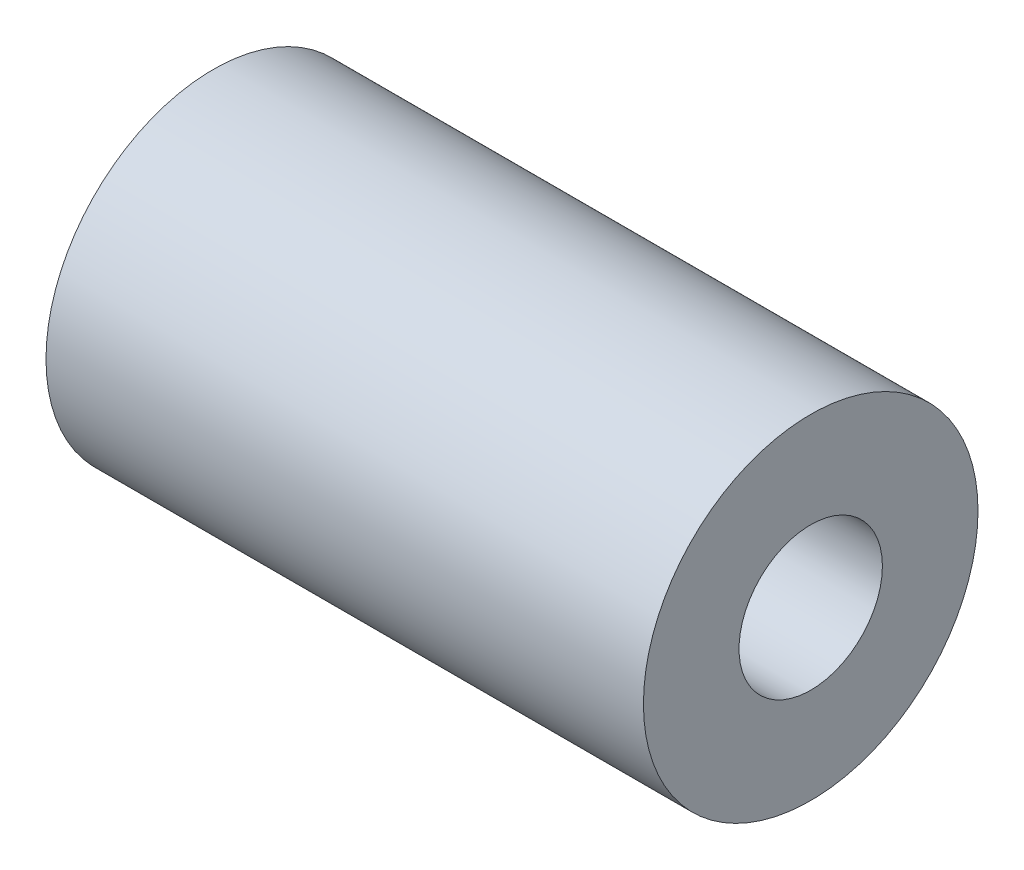
ISO-10303-21;
HEADER;
FILE_DESCRIPTION(('STEP AP214'),'2;1');
FILE_NAME('part.step','',(''),(''),'','','');
FILE_SCHEMA(('AUTOMOTIVE_DESIGN { 1 0 10303 214 1 1 1 1 }'));
ENDSEC;
DATA;
#1=APPLICATION_CONTEXT('core data for automotive mechanical design processes');
#2=APPLICATION_PROTOCOL_DEFINITION('international standard','automotive_design',2000,#1);
#3=PRODUCT_CONTEXT('',#1,'mechanical');
#4=PRODUCT('Part','Part','',(#3));
#5=PRODUCT_RELATED_PRODUCT_CATEGORY('part','',(#4));
#6=PRODUCT_DEFINITION_FORMATION('','',#4);
#7=PRODUCT_DEFINITION_CONTEXT('part definition',#1,'design');
#8=PRODUCT_DEFINITION('design','',#6,#7);
#9=PRODUCT_DEFINITION_SHAPE('','',#8);
#10=(LENGTH_UNIT() NAMED_UNIT(*) SI_UNIT(.MILLI.,.METRE.));
#11=(NAMED_UNIT(*) PLANE_ANGLE_UNIT() SI_UNIT($,.RADIAN.));
#12=(NAMED_UNIT(*) SI_UNIT($,.STERADIAN.) SOLID_ANGLE_UNIT());
#13=UNCERTAINTY_MEASURE_WITH_UNIT(LENGTH_MEASURE(1.E-05),#10,'distance_accuracy_value','');
#14=(GEOMETRIC_REPRESENTATION_CONTEXT(3) GLOBAL_UNCERTAINTY_ASSIGNED_CONTEXT((#13)) GLOBAL_UNIT_ASSIGNED_CONTEXT((#10,
#11,#12)) REPRESENTATION_CONTEXT('',''));
#15=CARTESIAN_POINT('',(0.,0.,0.));
#16=DIRECTION('',(0.,0.,1.));
#17=DIRECTION('',(1.,0.,0.));
#18=AXIS2_PLACEMENT_3D('',#15,#16,#17);
#19=CARTESIAN_POINT('',(12.5,0.,0.));
#20=DIRECTION('',(1.,0.,0.));
#21=DIRECTION('',(0.,0.,-1.));
#22=AXIS2_PLACEMENT_3D('',#19,#20,#21);
#23=PLANE('',#22);
#24=CARTESIAN_POINT('',(12.5,0.,0.));
#25=DIRECTION('',(1.,0.,0.));
#26=DIRECTION('',(0.,0.,-1.));
#27=AXIS2_PLACEMENT_3D('',#24,#25,#26);
#28=CIRCLE('',#27,3.5);
#29=CARTESIAN_POINT('',(12.5,0.,-3.5));
#30=VERTEX_POINT('',#29);
#31=EDGE_CURVE('E10',#30,#30,#28,.T.);
#32=ORIENTED_EDGE('',*,*,#31,.T.);
#33=EDGE_LOOP('',(#32));
#34=FACE_BOUND('',#33,.T.);
#35=CARTESIAN_POINT('',(12.5,0.,0.));
#36=DIRECTION('',(1.,0.,0.));
#37=DIRECTION('',(0.,0.,-1.));
#38=AXIS2_PLACEMENT_3D('',#35,#36,#37);
#39=CIRCLE('',#38,1.5);
#40=CARTESIAN_POINT('',(12.5,0.,-1.5));
#41=VERTEX_POINT('',#40);
#42=EDGE_CURVE('E44',#41,#41,#39,.T.);
#43=ORIENTED_EDGE('',*,*,#42,.F.);
#44=EDGE_LOOP('',(#43));
#45=FACE_BOUND('',#44,.T.);
#46=ADVANCED_FACE('F33',(#34,#45),#23,.T.);
#47=CARTESIAN_POINT('',(0.,0.,0.));
#48=DIRECTION('',(1.,0.,0.));
#49=DIRECTION('',(0.,0.,-1.));
#50=AXIS2_PLACEMENT_3D('',#47,#48,#49);
#51=PLANE('',#50);
#52=CARTESIAN_POINT('',(0.,0.,0.));
#53=DIRECTION('',(1.,0.,0.));
#54=DIRECTION('',(0.,0.,-1.));
#55=AXIS2_PLACEMENT_3D('',#52,#53,#54);
#56=CIRCLE('',#55,3.5);
#57=CARTESIAN_POINT('',(0.,0.,-3.5));
#58=VERTEX_POINT('',#57);
#59=EDGE_CURVE('E37',#58,#58,#56,.T.);
#60=ORIENTED_EDGE('',*,*,#59,.F.);
#61=EDGE_LOOP('',(#60));
#62=FACE_BOUND('',#61,.T.);
#63=CARTESIAN_POINT('',(0.,0.,0.));
#64=DIRECTION('',(1.,0.,0.));
#65=DIRECTION('',(0.,0.,-1.));
#66=AXIS2_PLACEMENT_3D('',#63,#64,#65);
#67=CIRCLE('',#66,1.5);
#68=CARTESIAN_POINT('',(0.,0.,-1.5));
#69=VERTEX_POINT('',#68);
#70=EDGE_CURVE('E46',#69,#69,#67,.T.);
#71=ORIENTED_EDGE('',*,*,#70,.T.);
#72=EDGE_LOOP('',(#71));
#73=FACE_BOUND('',#72,.T.);
#74=ADVANCED_FACE('F56',(#62,#73),#51,.F.);
#75=CARTESIAN_POINT('',(12.5,0.,0.));
#76=DIRECTION('',(-1.,0.,0.));
#77=DIRECTION('',(0.,0.,1.));
#78=AXIS2_PLACEMENT_3D('',#75,#76,#77);
#79=CYLINDRICAL_SURFACE('',#78,3.5);
#80=ORIENTED_EDGE('',*,*,#31,.F.);
#81=EDGE_LOOP('',(#80));
#82=FACE_BOUND('',#81,.T.);
#83=ORIENTED_EDGE('',*,*,#59,.T.);
#84=EDGE_LOOP('',(#83));
#85=FACE_BOUND('',#84,.T.);
#86=ADVANCED_FACE('F35',(#82,#85),#79,.T.);
#87=CARTESIAN_POINT('',(12.5,0.,0.));
#88=DIRECTION('',(-1.,0.,0.));
#89=DIRECTION('',(0.,0.,1.));
#90=AXIS2_PLACEMENT_3D('',#87,#88,#89);
#91=CYLINDRICAL_SURFACE('',#90,1.5);
#92=ORIENTED_EDGE('',*,*,#42,.T.);
#93=EDGE_LOOP('',(#92));
#94=FACE_BOUND('',#93,.T.);
#95=ORIENTED_EDGE('',*,*,#70,.F.);
#96=EDGE_LOOP('',(#95));
#97=FACE_BOUND('',#96,.T.);
#98=ADVANCED_FACE('F52',(#94,#97),#91,.F.);
#99=CLOSED_SHELL('',(#46,#74,#86,#98));
#100=MANIFOLD_SOLID_BREP('B2',#99);
#101=ADVANCED_BREP_SHAPE_REPRESENTATION('',(#18,#100),#14);
#102=SHAPE_DEFINITION_REPRESENTATION(#9,#101);
ENDSEC;
END-ISO-10303-21;
